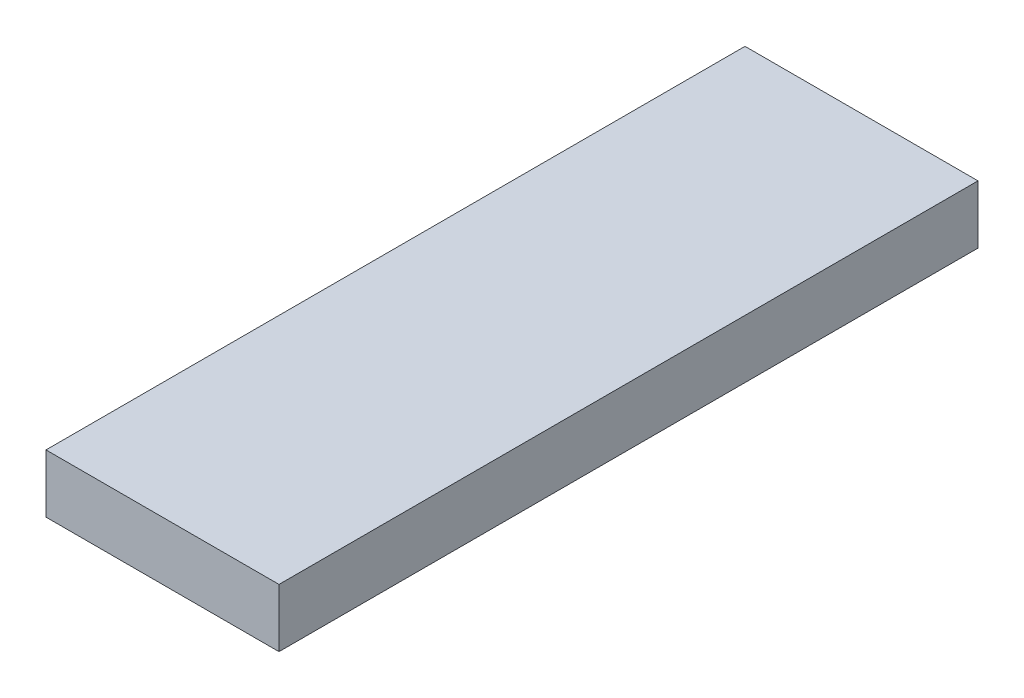
ISO-10303-21;
HEADER;
FILE_DESCRIPTION(('STEP AP214'),'2;1');
FILE_NAME('part.step','',(''),(''),'','','');
FILE_SCHEMA(('AUTOMOTIVE_DESIGN { 1 0 10303 214 1 1 1 1 }'));
ENDSEC;
DATA;
#1=APPLICATION_CONTEXT('core data for automotive mechanical design processes');
#2=APPLICATION_PROTOCOL_DEFINITION('international standard','automotive_design',2000,#1);
#3=PRODUCT_CONTEXT('',#1,'mechanical');
#4=PRODUCT('Part','Part','',(#3));
#5=PRODUCT_RELATED_PRODUCT_CATEGORY('part','',(#4));
#6=PRODUCT_DEFINITION_FORMATION('','',#4);
#7=PRODUCT_DEFINITION_CONTEXT('part definition',#1,'design');
#8=PRODUCT_DEFINITION('design','',#6,#7);
#9=PRODUCT_DEFINITION_SHAPE('','',#8);
#10=(LENGTH_UNIT() NAMED_UNIT(*) SI_UNIT(.MILLI.,.METRE.));
#11=(NAMED_UNIT(*) PLANE_ANGLE_UNIT() SI_UNIT($,.RADIAN.));
#12=(NAMED_UNIT(*) SI_UNIT($,.STERADIAN.) SOLID_ANGLE_UNIT());
#13=UNCERTAINTY_MEASURE_WITH_UNIT(LENGTH_MEASURE(1.E-05),#10,'distance_accuracy_value','');
#14=(GEOMETRIC_REPRESENTATION_CONTEXT(3) GLOBAL_UNCERTAINTY_ASSIGNED_CONTEXT((#13)) GLOBAL_UNIT_ASSIGNED_CONTEXT((#10,
#11,#12)) REPRESENTATION_CONTEXT('',''));
#15=CARTESIAN_POINT('',(0.,0.,0.));
#16=DIRECTION('',(0.,0.,1.));
#17=DIRECTION('',(1.,0.,0.));
#18=AXIS2_PLACEMENT_3D('',#15,#16,#17);
#19=CARTESIAN_POINT('',(10.,-2.5,30.));
#20=DIRECTION('',(-1.,0.,0.));
#21=DIRECTION('',(0.,0.,1.));
#22=AXIS2_PLACEMENT_3D('',#19,#20,#21);
#23=PLANE('',#22);
#24=DIRECTION('',(0.,1.,0.));
#25=VECTOR('',#24,1.);
#26=CARTESIAN_POINT('',(10.,-2.5,-30.));
#27=LINE('',#26,#25);
#28=CARTESIAN_POINT('',(10.,-2.5,-30.));
#29=VERTEX_POINT('',#28);
#30=CARTESIAN_POINT('',(10.,2.5,-30.));
#31=VERTEX_POINT('',#30);
#32=EDGE_CURVE('E104',#29,#31,#27,.T.);
#33=ORIENTED_EDGE('',*,*,#32,.T.);
#34=DIRECTION('',(0.,0.,-1.));
#35=VECTOR('',#34,1.);
#36=CARTESIAN_POINT('',(10.,2.5,30.));
#37=LINE('',#36,#35);
#38=CARTESIAN_POINT('',(10.,2.5,30.));
#39=VERTEX_POINT('',#38);
#40=EDGE_CURVE('E11',#39,#31,#37,.T.);
#41=ORIENTED_EDGE('',*,*,#40,.F.);
#42=DIRECTION('',(0.,1.,0.));
#43=VECTOR('',#42,1.);
#44=CARTESIAN_POINT('',(10.,-2.5,30.));
#45=LINE('',#44,#43);
#46=CARTESIAN_POINT('',(10.,-2.5,30.));
#47=VERTEX_POINT('',#46);
#48=EDGE_CURVE('E92',#47,#39,#45,.T.);
#49=ORIENTED_EDGE('',*,*,#48,.F.);
#50=DIRECTION('',(0.,0.,-1.));
#51=VECTOR('',#50,1.);
#52=CARTESIAN_POINT('',(10.,-2.5,30.));
#53=LINE('',#52,#51);
#54=EDGE_CURVE('E100',#47,#29,#53,.T.);
#55=ORIENTED_EDGE('',*,*,#54,.T.);
#56=EDGE_LOOP('',(#33,#41,#49,#55));
#57=FACE_BOUND('',#56,.T.);
#58=ADVANCED_FACE('F41',(#57),#23,.F.);
#59=CARTESIAN_POINT('',(-10.,2.5,30.));
#60=DIRECTION('',(0.,-1.,0.));
#61=DIRECTION('',(0.,0.,-1.));
#62=AXIS2_PLACEMENT_3D('',#59,#60,#61);
#63=PLANE('',#62);
#64=DIRECTION('',(-1.,0.,0.));
#65=VECTOR('',#64,1.);
#66=CARTESIAN_POINT('',(-10.,2.5,-30.));
#67=LINE('',#66,#65);
#68=CARTESIAN_POINT('',(-10.,2.5,-30.));
#69=VERTEX_POINT('',#68);
#70=EDGE_CURVE('E96',#31,#69,#67,.T.);
#71=ORIENTED_EDGE('',*,*,#70,.T.);
#72=DIRECTION('',(0.,0.,-1.));
#73=VECTOR('',#72,1.);
#74=CARTESIAN_POINT('',(-10.,2.5,30.));
#75=LINE('',#74,#73);
#76=CARTESIAN_POINT('',(-10.,2.5,30.));
#77=VERTEX_POINT('',#76);
#78=EDGE_CURVE('E49',#77,#69,#75,.T.);
#79=ORIENTED_EDGE('',*,*,#78,.F.);
#80=DIRECTION('',(-1.,0.,0.));
#81=VECTOR('',#80,1.);
#82=CARTESIAN_POINT('',(-10.,2.5,30.));
#83=LINE('',#82,#81);
#84=EDGE_CURVE('E87',#39,#77,#83,.T.);
#85=ORIENTED_EDGE('',*,*,#84,.F.);
#86=ORIENTED_EDGE('',*,*,#40,.T.);
#87=EDGE_LOOP('',(#71,#79,#85,#86));
#88=FACE_BOUND('',#87,.T.);
#89=ADVANCED_FACE('F95',(#88),#63,.F.);
#90=CARTESIAN_POINT('',(-10.,-2.5,30.));
#91=DIRECTION('',(1.,0.,0.));
#92=DIRECTION('',(0.,0.,-1.));
#93=AXIS2_PLACEMENT_3D('',#90,#91,#92);
#94=PLANE('',#93);
#95=DIRECTION('',(0.,-1.,0.));
#96=VECTOR('',#95,1.);
#97=CARTESIAN_POINT('',(-10.,-2.5,-30.));
#98=LINE('',#97,#96);
#99=CARTESIAN_POINT('',(-10.,-2.5,-30.));
#100=VERTEX_POINT('',#99);
#101=EDGE_CURVE('E74',#69,#100,#98,.T.);
#102=ORIENTED_EDGE('',*,*,#101,.T.);
#103=DIRECTION('',(0.,0.,-1.));
#104=VECTOR('',#103,1.);
#105=CARTESIAN_POINT('',(-10.,-2.5,30.));
#106=LINE('',#105,#104);
#107=CARTESIAN_POINT('',(-10.,-2.5,30.));
#108=VERTEX_POINT('',#107);
#109=EDGE_CURVE('E97',#108,#100,#106,.T.);
#110=ORIENTED_EDGE('',*,*,#109,.F.);
#111=DIRECTION('',(0.,-1.,0.));
#112=VECTOR('',#111,1.);
#113=CARTESIAN_POINT('',(-10.,-2.5,30.));
#114=LINE('',#113,#112);
#115=EDGE_CURVE('E90',#77,#108,#114,.T.);
#116=ORIENTED_EDGE('',*,*,#115,.F.);
#117=ORIENTED_EDGE('',*,*,#78,.T.);
#118=EDGE_LOOP('',(#102,#110,#116,#117));
#119=FACE_BOUND('',#118,.T.);
#120=ADVANCED_FACE('F98',(#119),#94,.F.);
#121=CARTESIAN_POINT('',(-10.,-2.5,30.));
#122=DIRECTION('',(0.,1.,0.));
#123=DIRECTION('',(0.,0.,1.));
#124=AXIS2_PLACEMENT_3D('',#121,#122,#123);
#125=PLANE('',#124);
#126=DIRECTION('',(1.,0.,0.));
#127=VECTOR('',#126,1.);
#128=CARTESIAN_POINT('',(-10.,-2.5,-30.));
#129=LINE('',#128,#127);
#130=EDGE_CURVE('E80',#100,#29,#129,.T.);
#131=ORIENTED_EDGE('',*,*,#130,.T.);
#132=ORIENTED_EDGE('',*,*,#54,.F.);
#133=DIRECTION('',(1.,0.,0.));
#134=VECTOR('',#133,1.);
#135=CARTESIAN_POINT('',(-10.,-2.5,30.));
#136=LINE('',#135,#134);
#137=EDGE_CURVE('E57',#108,#47,#136,.T.);
#138=ORIENTED_EDGE('',*,*,#137,.F.);
#139=ORIENTED_EDGE('',*,*,#109,.T.);
#140=EDGE_LOOP('',(#131,#132,#138,#139));
#141=FACE_BOUND('',#140,.T.);
#142=ADVANCED_FACE('F111',(#141),#125,.F.);
#143=CARTESIAN_POINT('',(0.,0.,30.));
#144=DIRECTION('',(0.,0.,-1.));
#145=DIRECTION('',(-1.,0.,0.));
#146=AXIS2_PLACEMENT_3D('',#143,#144,#145);
#147=PLANE('',#146);
#148=ORIENTED_EDGE('',*,*,#48,.T.);
#149=ORIENTED_EDGE('',*,*,#84,.T.);
#150=ORIENTED_EDGE('',*,*,#115,.T.);
#151=ORIENTED_EDGE('',*,*,#137,.T.);
#152=EDGE_LOOP('',(#148,#149,#150,#151));
#153=FACE_BOUND('',#152,.T.);
#154=ADVANCED_FACE('F88',(#153),#147,.F.);
#155=CARTESIAN_POINT('',(0.,0.,-30.));
#156=DIRECTION('',(0.,0.,-1.));
#157=DIRECTION('',(-1.,0.,0.));
#158=AXIS2_PLACEMENT_3D('',#155,#156,#157);
#159=PLANE('',#158);
#160=ORIENTED_EDGE('',*,*,#32,.F.);
#161=ORIENTED_EDGE('',*,*,#130,.F.);
#162=ORIENTED_EDGE('',*,*,#101,.F.);
#163=ORIENTED_EDGE('',*,*,#70,.F.);
#164=EDGE_LOOP('',(#160,#161,#162,#163));
#165=FACE_BOUND('',#164,.T.);
#166=ADVANCED_FACE('F114',(#165),#159,.T.);
#167=CLOSED_SHELL('',(#58,#89,#120,#142,#154,#166));
#168=MANIFOLD_SOLID_BREP('B2',#167);
#169=ADVANCED_BREP_SHAPE_REPRESENTATION('',(#18,#168),#14);
#170=SHAPE_DEFINITION_REPRESENTATION(#9,#169);
ENDSEC;
END-ISO-10303-21;
